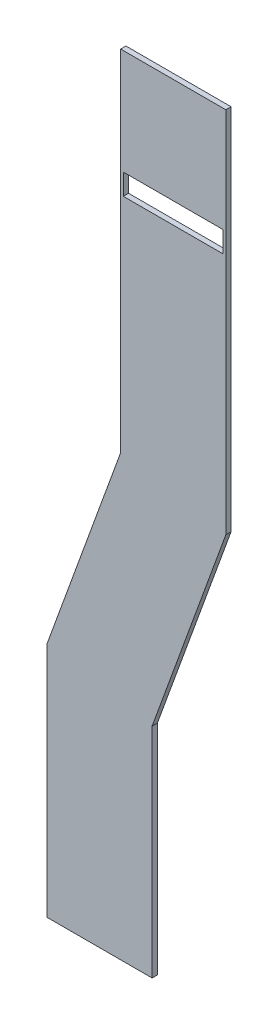
ISO-10303-21;
HEADER;
FILE_DESCRIPTION(('STEP AP214'),'2;1');
FILE_NAME('part.step','',(''),(''),'','','');
FILE_SCHEMA(('AUTOMOTIVE_DESIGN { 1 0 10303 214 1 1 1 1 }'));
ENDSEC;
DATA;
#1=APPLICATION_CONTEXT('core data for automotive mechanical design processes');
#2=APPLICATION_PROTOCOL_DEFINITION('international standard','automotive_design',2000,#1);
#3=PRODUCT_CONTEXT('',#1,'mechanical');
#4=PRODUCT('Part','Part','',(#3));
#5=PRODUCT_RELATED_PRODUCT_CATEGORY('part','',(#4));
#6=PRODUCT_DEFINITION_FORMATION('','',#4);
#7=PRODUCT_DEFINITION_CONTEXT('part definition',#1,'design');
#8=PRODUCT_DEFINITION('design','',#6,#7);
#9=PRODUCT_DEFINITION_SHAPE('','',#8);
#10=(LENGTH_UNIT() NAMED_UNIT(*) SI_UNIT(.MILLI.,.METRE.));
#11=(NAMED_UNIT(*) PLANE_ANGLE_UNIT() SI_UNIT($,.RADIAN.));
#12=(NAMED_UNIT(*) SI_UNIT($,.STERADIAN.) SOLID_ANGLE_UNIT());
#13=UNCERTAINTY_MEASURE_WITH_UNIT(LENGTH_MEASURE(1.E-05),#10,'distance_accuracy_value','');
#14=(GEOMETRIC_REPRESENTATION_CONTEXT(3) GLOBAL_UNCERTAINTY_ASSIGNED_CONTEXT((#13)) GLOBAL_UNIT_ASSIGNED_CONTEXT((#10,
#11,#12)) REPRESENTATION_CONTEXT('',''));
#15=CARTESIAN_POINT('',(0.,0.,0.));
#16=DIRECTION('',(0.,0.,1.));
#17=DIRECTION('',(1.,0.,0.));
#18=AXIS2_PLACEMENT_3D('',#15,#16,#17);
#19=CARTESIAN_POINT('',(-20.,0.,1.));
#20=DIRECTION('',(1.,0.,0.));
#21=DIRECTION('',(0.,1.,0.));
#22=AXIS2_PLACEMENT_3D('',#19,#20,#21);
#23=PLANE('',#22);
#24=DIRECTION('',(0.,-1.,0.));
#25=VECTOR('',#24,1.);
#26=CARTESIAN_POINT('',(-20.,0.,0.));
#27=LINE('',#26,#25);
#28=CARTESIAN_POINT('',(-20.,0.,0.));
#29=VERTEX_POINT('',#28);
#30=CARTESIAN_POINT('',(-20.,-66.4734603858307,0.));
#31=VERTEX_POINT('',#30);
#32=EDGE_CURVE('E173',#29,#31,#27,.T.);
#33=ORIENTED_EDGE('',*,*,#32,.T.);
#34=DIRECTION('',(0.,0.,-1.));
#35=VECTOR('',#34,1.);
#36=CARTESIAN_POINT('',(-20.,-66.4734603858307,1.));
#37=LINE('',#36,#35);
#38=CARTESIAN_POINT('',(-20.,-66.4734603858307,1.));
#39=VERTEX_POINT('',#38);
#40=EDGE_CURVE('E11',#39,#31,#37,.T.);
#41=ORIENTED_EDGE('',*,*,#40,.F.);
#42=DIRECTION('',(0.,-1.,0.));
#43=VECTOR('',#42,1.);
#44=CARTESIAN_POINT('',(-20.,0.,1.));
#45=LINE('',#44,#43);
#46=CARTESIAN_POINT('',(-20.,0.,1.));
#47=VERTEX_POINT('',#46);
#48=EDGE_CURVE('E174',#47,#39,#45,.T.);
#49=ORIENTED_EDGE('',*,*,#48,.F.);
#50=DIRECTION('',(0.,0.,-1.));
#51=VECTOR('',#50,1.);
#52=CARTESIAN_POINT('',(-20.,0.,1.));
#53=LINE('',#52,#51);
#54=EDGE_CURVE('E200',#47,#29,#53,.T.);
#55=ORIENTED_EDGE('',*,*,#54,.T.);
#56=EDGE_LOOP('',(#33,#41,#49,#55));
#57=FACE_BOUND('',#56,.T.);
#58=ADVANCED_FACE('F38',(#57),#23,.F.);
#59=CARTESIAN_POINT('',(-20.,-66.4734603858307,1.));
#60=DIRECTION('',(0.939692620785908,-0.34202014332567,0.));
#61=DIRECTION('',(0.34202014332567,0.939692620785908,0.));
#62=AXIS2_PLACEMENT_3D('',#59,#60,#61);
#63=PLANE('',#62);
#64=DIRECTION('',(-0.34202014332567,-0.939692620785908,0.));
#65=VECTOR('',#64,1.);
#66=CARTESIAN_POINT('',(-20.,-66.4734603858307,0.));
#67=LINE('',#66,#65);
#68=CARTESIAN_POINT('',(-34.0225136488354,-105.,0.));
#69=VERTEX_POINT('',#68);
#70=EDGE_CURVE('E204',#31,#69,#67,.T.);
#71=ORIENTED_EDGE('',*,*,#70,.T.);
#72=DIRECTION('',(0.,0.,-1.));
#73=VECTOR('',#72,1.);
#74=CARTESIAN_POINT('',(-34.0225136488354,-105.,1.));
#75=LINE('',#74,#73);
#76=CARTESIAN_POINT('',(-34.0225136488354,-105.,1.));
#77=VERTEX_POINT('',#76);
#78=EDGE_CURVE('E46',#77,#69,#75,.T.);
#79=ORIENTED_EDGE('',*,*,#78,.F.);
#80=DIRECTION('',(-0.34202014332567,-0.939692620785908,0.));
#81=VECTOR('',#80,1.);
#82=CARTESIAN_POINT('',(-20.,-66.4734603858307,1.));
#83=LINE('',#82,#81);
#84=EDGE_CURVE('E178',#39,#77,#83,.T.);
#85=ORIENTED_EDGE('',*,*,#84,.F.);
#86=ORIENTED_EDGE('',*,*,#40,.T.);
#87=EDGE_LOOP('',(#71,#79,#85,#86));
#88=FACE_BOUND('',#87,.T.);
#89=ADVANCED_FACE('F273',(#88),#63,.F.);
#90=CARTESIAN_POINT('',(-34.0225136488354,-105.,1.));
#91=DIRECTION('',(1.,0.,0.));
#92=DIRECTION('',(0.,1.,0.));
#93=AXIS2_PLACEMENT_3D('',#90,#91,#92);
#94=PLANE('',#93);
#95=DIRECTION('',(0.,-1.,0.));
#96=VECTOR('',#95,1.);
#97=CARTESIAN_POINT('',(-34.0225136488354,-105.,0.));
#98=LINE('',#97,#96);
#99=CARTESIAN_POINT('',(-34.0225136488354,-150.,0.));
#100=VERTEX_POINT('',#99);
#101=EDGE_CURVE('E207',#69,#100,#98,.T.);
#102=ORIENTED_EDGE('',*,*,#101,.T.);
#103=DIRECTION('',(0.,0.,-1.));
#104=VECTOR('',#103,1.);
#105=CARTESIAN_POINT('',(-34.0225136488354,-150.,1.));
#106=LINE('',#105,#104);
#107=CARTESIAN_POINT('',(-34.0225136488354,-150.,1.));
#108=VERTEX_POINT('',#107);
#109=EDGE_CURVE('E243',#108,#100,#106,.T.);
#110=ORIENTED_EDGE('',*,*,#109,.F.);
#111=DIRECTION('',(0.,-1.,0.));
#112=VECTOR('',#111,1.);
#113=CARTESIAN_POINT('',(-34.0225136488354,-105.,1.));
#114=LINE('',#113,#112);
#115=EDGE_CURVE('E182',#77,#108,#114,.T.);
#116=ORIENTED_EDGE('',*,*,#115,.F.);
#117=ORIENTED_EDGE('',*,*,#78,.T.);
#118=EDGE_LOOP('',(#102,#110,#116,#117));
#119=FACE_BOUND('',#118,.T.);
#120=ADVANCED_FACE('F252',(#119),#94,.F.);
#121=CARTESIAN_POINT('',(-34.0225136488354,-150.,1.));
#122=DIRECTION('',(0.,1.,0.));
#123=DIRECTION('',(0.,0.,1.));
#124=AXIS2_PLACEMENT_3D('',#121,#122,#123);
#125=PLANE('',#124);
#126=DIRECTION('',(1.,0.,0.));
#127=VECTOR('',#126,1.);
#128=CARTESIAN_POINT('',(-34.0225136488354,-150.,0.));
#129=LINE('',#128,#127);
#130=CARTESIAN_POINT('',(-14.0225136488354,-150.,0.));
#131=VERTEX_POINT('',#130);
#132=EDGE_CURVE('E210',#100,#131,#129,.T.);
#133=ORIENTED_EDGE('',*,*,#132,.T.);
#134=DIRECTION('',(0.,0.,-1.));
#135=VECTOR('',#134,1.);
#136=CARTESIAN_POINT('',(-14.0225136488354,-150.,1.));
#137=LINE('',#136,#135);
#138=CARTESIAN_POINT('',(-14.0225136488354,-150.,1.));
#139=VERTEX_POINT('',#138);
#140=EDGE_CURVE('E239',#139,#131,#137,.T.);
#141=ORIENTED_EDGE('',*,*,#140,.F.);
#142=DIRECTION('',(1.,0.,0.));
#143=VECTOR('',#142,1.);
#144=CARTESIAN_POINT('',(-34.0225136488354,-150.,1.));
#145=LINE('',#144,#143);
#146=EDGE_CURVE('E185',#108,#139,#145,.T.);
#147=ORIENTED_EDGE('',*,*,#146,.F.);
#148=ORIENTED_EDGE('',*,*,#109,.T.);
#149=EDGE_LOOP('',(#133,#141,#147,#148));
#150=FACE_BOUND('',#149,.T.);
#151=ADVANCED_FACE('F263',(#150),#125,.F.);
#152=CARTESIAN_POINT('',(-14.0225136488354,-150.,1.));
#153=DIRECTION('',(-1.,0.,0.));
#154=DIRECTION('',(0.,0.,1.));
#155=AXIS2_PLACEMENT_3D('',#152,#153,#154);
#156=PLANE('',#155);
#157=DIRECTION('',(0.,1.,0.));
#158=VECTOR('',#157,1.);
#159=CARTESIAN_POINT('',(-14.0225136488354,-150.,0.));
#160=LINE('',#159,#158);
#161=CARTESIAN_POINT('',(-14.0225136488354,-108.526539614169,0.));
#162=VERTEX_POINT('',#161);
#163=EDGE_CURVE('E213',#131,#162,#160,.T.);
#164=ORIENTED_EDGE('',*,*,#163,.T.);
#165=DIRECTION('',(0.,0.,-1.));
#166=VECTOR('',#165,1.);
#167=CARTESIAN_POINT('',(-14.0225136488354,-108.526539614169,1.));
#168=LINE('',#167,#166);
#169=CARTESIAN_POINT('',(-14.0225136488354,-108.526539614169,1.));
#170=VERTEX_POINT('',#169);
#171=EDGE_CURVE('E235',#170,#162,#168,.T.);
#172=ORIENTED_EDGE('',*,*,#171,.F.);
#173=DIRECTION('',(0.,1.,0.));
#174=VECTOR('',#173,1.);
#175=CARTESIAN_POINT('',(-14.0225136488354,-150.,1.));
#176=LINE('',#175,#174);
#177=EDGE_CURVE('E188',#139,#170,#176,.T.);
#178=ORIENTED_EDGE('',*,*,#177,.F.);
#179=ORIENTED_EDGE('',*,*,#140,.T.);
#180=EDGE_LOOP('',(#164,#172,#178,#179));
#181=FACE_BOUND('',#180,.T.);
#182=ADVANCED_FACE('F267',(#181),#156,.F.);
#183=CARTESIAN_POINT('',(-14.0225136488354,-108.526539614169,1.));
#184=DIRECTION('',(-0.939692620785908,0.34202014332567,0.));
#185=DIRECTION('',(-0.34202014332567,-0.939692620785908,0.));
#186=AXIS2_PLACEMENT_3D('',#183,#184,#185);
#187=PLANE('',#186);
#188=DIRECTION('',(0.34202014332567,0.939692620785908,0.));
#189=VECTOR('',#188,1.);
#190=CARTESIAN_POINT('',(-14.0225136488354,-108.526539614169,0.));
#191=LINE('',#190,#189);
#192=CARTESIAN_POINT('',(0.,-70.,0.));
#193=VERTEX_POINT('',#192);
#194=EDGE_CURVE('E216',#162,#193,#191,.T.);
#195=ORIENTED_EDGE('',*,*,#194,.T.);
#196=DIRECTION('',(0.,0.,-1.));
#197=VECTOR('',#196,1.);
#198=CARTESIAN_POINT('',(0.,-70.,1.));
#199=LINE('',#198,#197);
#200=CARTESIAN_POINT('',(0.,-70.,1.));
#201=VERTEX_POINT('',#200);
#202=EDGE_CURVE('E231',#201,#193,#199,.T.);
#203=ORIENTED_EDGE('',*,*,#202,.F.);
#204=DIRECTION('',(0.34202014332567,0.939692620785908,0.));
#205=VECTOR('',#204,1.);
#206=CARTESIAN_POINT('',(-14.0225136488354,-108.526539614169,1.));
#207=LINE('',#206,#205);
#208=EDGE_CURVE('E191',#170,#201,#207,.T.);
#209=ORIENTED_EDGE('',*,*,#208,.F.);
#210=ORIENTED_EDGE('',*,*,#171,.T.);
#211=EDGE_LOOP('',(#195,#203,#209,#210));
#212=FACE_BOUND('',#211,.T.);
#213=ADVANCED_FACE('F286',(#212),#187,.F.);
#214=CARTESIAN_POINT('',(0.,-70.,1.));
#215=DIRECTION('',(-1.,0.,0.));
#216=DIRECTION('',(0.,-1.,0.));
#217=AXIS2_PLACEMENT_3D('',#214,#215,#216);
#218=PLANE('',#217);
#219=DIRECTION('',(0.,1.,0.));
#220=VECTOR('',#219,1.);
#221=CARTESIAN_POINT('',(0.,-70.,0.));
#222=LINE('',#221,#220);
#223=CARTESIAN_POINT('',(0.,0.,0.));
#224=VERTEX_POINT('',#223);
#225=EDGE_CURVE('E219',#193,#224,#222,.T.);
#226=ORIENTED_EDGE('',*,*,#225,.T.);
#227=DIRECTION('',(0.,0.,-1.));
#228=VECTOR('',#227,1.);
#229=CARTESIAN_POINT('',(0.,0.,1.));
#230=LINE('',#229,#228);
#231=CARTESIAN_POINT('',(0.,0.,1.));
#232=VERTEX_POINT('',#231);
#233=EDGE_CURVE('E227',#232,#224,#230,.T.);
#234=ORIENTED_EDGE('',*,*,#233,.F.);
#235=DIRECTION('',(0.,1.,0.));
#236=VECTOR('',#235,1.);
#237=CARTESIAN_POINT('',(0.,-70.,1.));
#238=LINE('',#237,#236);
#239=EDGE_CURVE('E194',#201,#232,#238,.T.);
#240=ORIENTED_EDGE('',*,*,#239,.F.);
#241=ORIENTED_EDGE('',*,*,#202,.T.);
#242=EDGE_LOOP('',(#226,#234,#240,#241));
#243=FACE_BOUND('',#242,.T.);
#244=ADVANCED_FACE('F284',(#243),#218,.F.);
#245=CARTESIAN_POINT('',(0.,0.,1.));
#246=DIRECTION('',(0.,-1.,0.));
#247=DIRECTION('',(1.,0.,0.));
#248=AXIS2_PLACEMENT_3D('',#245,#246,#247);
#249=PLANE('',#248);
#250=DIRECTION('',(-1.,0.,0.));
#251=VECTOR('',#250,1.);
#252=CARTESIAN_POINT('',(0.,0.,0.));
#253=LINE('',#252,#251);
#254=EDGE_CURVE('E179',#224,#29,#253,.T.);
#255=ORIENTED_EDGE('',*,*,#254,.T.);
#256=ORIENTED_EDGE('',*,*,#54,.F.);
#257=DIRECTION('',(-1.,0.,0.));
#258=VECTOR('',#257,1.);
#259=CARTESIAN_POINT('',(0.,0.,1.));
#260=LINE('',#259,#258);
#261=EDGE_CURVE('E197',#232,#47,#260,.T.);
#262=ORIENTED_EDGE('',*,*,#261,.F.);
#263=ORIENTED_EDGE('',*,*,#233,.T.);
#264=EDGE_LOOP('',(#255,#256,#262,#263));
#265=FACE_BOUND('',#264,.T.);
#266=ADVANCED_FACE('F279',(#265),#249,.F.);
#267=CARTESIAN_POINT('',(0.,0.,1.));
#268=DIRECTION('',(0.,0.,1.));
#269=DIRECTION('',(1.,0.,0.));
#270=AXIS2_PLACEMENT_3D('',#267,#268,#269);
#271=PLANE('',#270);
#272=DIRECTION('',(1.,0.,0.));
#273=VECTOR('',#272,1.);
#274=CARTESIAN_POINT('',(-19.5,-20.,1.));
#275=LINE('',#274,#273);
#276=CARTESIAN_POINT('',(-19.5,-20.,1.));
#277=VERTEX_POINT('',#276);
#278=CARTESIAN_POINT('',(-0.499999999999998,-20.,1.));
#279=VERTEX_POINT('',#278);
#280=EDGE_CURVE('E142',#277,#279,#275,.T.);
#281=ORIENTED_EDGE('',*,*,#280,.T.);
#282=DIRECTION('',(0.,-1.,0.));
#283=VECTOR('',#282,1.);
#284=CARTESIAN_POINT('',(-0.499999999999998,-20.,1.));
#285=LINE('',#284,#283);
#286=CARTESIAN_POINT('',(-0.499999999999999,-24.,1.));
#287=VERTEX_POINT('',#286);
#288=EDGE_CURVE('E128',#279,#287,#285,.T.);
#289=ORIENTED_EDGE('',*,*,#288,.T.);
#290=DIRECTION('',(-1.,0.,0.));
#291=VECTOR('',#290,1.);
#292=CARTESIAN_POINT('',(-0.499999999999999,-24.,1.));
#293=LINE('',#292,#291);
#294=CARTESIAN_POINT('',(-19.5,-24.,1.));
#295=VERTEX_POINT('',#294);
#296=EDGE_CURVE('E164',#287,#295,#293,.T.);
#297=ORIENTED_EDGE('',*,*,#296,.T.);
#298=DIRECTION('',(0.,1.,0.));
#299=VECTOR('',#298,1.);
#300=CARTESIAN_POINT('',(-19.5,-24.,1.));
#301=LINE('',#300,#299);
#302=EDGE_CURVE('E151',#295,#277,#301,.T.);
#303=ORIENTED_EDGE('',*,*,#302,.T.);
#304=EDGE_LOOP('',(#281,#289,#297,#303));
#305=FACE_BOUND('',#304,.T.);
#306=ORIENTED_EDGE('',*,*,#48,.T.);
#307=ORIENTED_EDGE('',*,*,#84,.T.);
#308=ORIENTED_EDGE('',*,*,#115,.T.);
#309=ORIENTED_EDGE('',*,*,#146,.T.);
#310=ORIENTED_EDGE('',*,*,#177,.T.);
#311=ORIENTED_EDGE('',*,*,#208,.T.);
#312=ORIENTED_EDGE('',*,*,#239,.T.);
#313=ORIENTED_EDGE('',*,*,#261,.T.);
#314=EDGE_LOOP('',(#306,#307,#308,#309,#310,#311,#312,#313));
#315=FACE_BOUND('',#314,.T.);
#316=ADVANCED_FACE('F149',(#305,#315),#271,.T.);
#317=CARTESIAN_POINT('',(0.,0.,0.));
#318=DIRECTION('',(0.,0.,1.));
#319=DIRECTION('',(1.,0.,0.));
#320=AXIS2_PLACEMENT_3D('',#317,#318,#319);
#321=PLANE('',#320);
#322=DIRECTION('',(0.,-1.,0.));
#323=VECTOR('',#322,1.);
#324=CARTESIAN_POINT('',(-0.499999999999998,-20.,0.));
#325=LINE('',#324,#323);
#326=CARTESIAN_POINT('',(-0.499999999999998,-20.,0.));
#327=VERTEX_POINT('',#326);
#328=CARTESIAN_POINT('',(-0.499999999999999,-24.,0.));
#329=VERTEX_POINT('',#328);
#330=EDGE_CURVE('E155',#327,#329,#325,.T.);
#331=ORIENTED_EDGE('',*,*,#330,.F.);
#332=DIRECTION('',(1.,0.,0.));
#333=VECTOR('',#332,1.);
#334=CARTESIAN_POINT('',(-19.5,-20.,0.));
#335=LINE('',#334,#333);
#336=CARTESIAN_POINT('',(-19.5,-20.,0.));
#337=VERTEX_POINT('',#336);
#338=EDGE_CURVE('E145',#337,#327,#335,.T.);
#339=ORIENTED_EDGE('',*,*,#338,.F.);
#340=DIRECTION('',(0.,1.,0.));
#341=VECTOR('',#340,1.);
#342=CARTESIAN_POINT('',(-19.5,-24.,0.));
#343=LINE('',#342,#341);
#344=CARTESIAN_POINT('',(-19.5,-24.,0.));
#345=VERTEX_POINT('',#344);
#346=EDGE_CURVE('E159',#345,#337,#343,.T.);
#347=ORIENTED_EDGE('',*,*,#346,.F.);
#348=DIRECTION('',(-1.,0.,0.));
#349=VECTOR('',#348,1.);
#350=CARTESIAN_POINT('',(-0.499999999999999,-24.,0.));
#351=LINE('',#350,#349);
#352=EDGE_CURVE('E61',#329,#345,#351,.T.);
#353=ORIENTED_EDGE('',*,*,#352,.F.);
#354=EDGE_LOOP('',(#331,#339,#347,#353));
#355=FACE_BOUND('',#354,.T.);
#356=ORIENTED_EDGE('',*,*,#32,.F.);
#357=ORIENTED_EDGE('',*,*,#254,.F.);
#358=ORIENTED_EDGE('',*,*,#225,.F.);
#359=ORIENTED_EDGE('',*,*,#194,.F.);
#360=ORIENTED_EDGE('',*,*,#163,.F.);
#361=ORIENTED_EDGE('',*,*,#132,.F.);
#362=ORIENTED_EDGE('',*,*,#101,.F.);
#363=ORIENTED_EDGE('',*,*,#70,.F.);
#364=EDGE_LOOP('',(#356,#357,#358,#359,#360,#361,#362,#363));
#365=FACE_BOUND('',#364,.T.);
#366=ADVANCED_FACE('F258',(#355,#365),#321,.F.);
#367=CARTESIAN_POINT('',(-19.5,-20.,20.4164878389476));
#368=DIRECTION('',(0.,1.,0.));
#369=DIRECTION('',(-1.,0.,0.));
#370=AXIS2_PLACEMENT_3D('',#367,#368,#369);
#371=PLANE('',#370);
#372=DIRECTION('',(0.,0.,-1.));
#373=VECTOR('',#372,1.);
#374=CARTESIAN_POINT('',(-19.5,-20.,20.4164878389476));
#375=LINE('',#374,#373);
#376=EDGE_CURVE('E53',#277,#337,#375,.T.);
#377=ORIENTED_EDGE('',*,*,#376,.T.);
#378=ORIENTED_EDGE('',*,*,#338,.T.);
#379=DIRECTION('',(0.,0.,-1.));
#380=VECTOR('',#379,1.);
#381=CARTESIAN_POINT('',(-0.499999999999998,-20.,20.4164878389476));
#382=LINE('',#381,#380);
#383=EDGE_CURVE('E132',#279,#327,#382,.T.);
#384=ORIENTED_EDGE('',*,*,#383,.F.);
#385=ORIENTED_EDGE('',*,*,#280,.F.);
#386=EDGE_LOOP('',(#377,#378,#384,#385));
#387=FACE_BOUND('',#386,.T.);
#388=ADVANCED_FACE('F141',(#387),#371,.F.);
#389=CARTESIAN_POINT('',(-0.499999999999998,-20.,20.4164878389476));
#390=DIRECTION('',(1.,0.,0.));
#391=DIRECTION('',(0.,1.,0.));
#392=AXIS2_PLACEMENT_3D('',#389,#390,#391);
#393=PLANE('',#392);
#394=ORIENTED_EDGE('',*,*,#383,.T.);
#395=ORIENTED_EDGE('',*,*,#330,.T.);
#396=DIRECTION('',(0.,0.,-1.));
#397=VECTOR('',#396,1.);
#398=CARTESIAN_POINT('',(-0.499999999999999,-24.,20.4164878389476));
#399=LINE('',#398,#397);
#400=EDGE_CURVE('E134',#287,#329,#399,.T.);
#401=ORIENTED_EDGE('',*,*,#400,.F.);
#402=ORIENTED_EDGE('',*,*,#288,.F.);
#403=EDGE_LOOP('',(#394,#395,#401,#402));
#404=FACE_BOUND('',#403,.T.);
#405=ADVANCED_FACE('F130',(#404),#393,.F.);
#406=CARTESIAN_POINT('',(-0.499999999999999,-24.,20.4164878389476));
#407=DIRECTION('',(0.,-1.,0.));
#408=DIRECTION('',(0.,0.,-1.));
#409=AXIS2_PLACEMENT_3D('',#406,#407,#408);
#410=PLANE('',#409);
#411=ORIENTED_EDGE('',*,*,#400,.T.);
#412=ORIENTED_EDGE('',*,*,#352,.T.);
#413=DIRECTION('',(0.,0.,-1.));
#414=VECTOR('',#413,1.);
#415=CARTESIAN_POINT('',(-19.5,-24.,20.4164878389476));
#416=LINE('',#415,#414);
#417=EDGE_CURVE('E163',#295,#345,#416,.T.);
#418=ORIENTED_EDGE('',*,*,#417,.F.);
#419=ORIENTED_EDGE('',*,*,#296,.F.);
#420=EDGE_LOOP('',(#411,#412,#418,#419));
#421=FACE_BOUND('',#420,.T.);
#422=ADVANCED_FACE('F361',(#421),#410,.F.);
#423=CARTESIAN_POINT('',(-19.5,-24.,20.4164878389476));
#424=DIRECTION('',(-1.,0.,0.));
#425=DIRECTION('',(0.,0.,1.));
#426=AXIS2_PLACEMENT_3D('',#423,#424,#425);
#427=PLANE('',#426);
#428=ORIENTED_EDGE('',*,*,#417,.T.);
#429=ORIENTED_EDGE('',*,*,#346,.T.);
#430=ORIENTED_EDGE('',*,*,#376,.F.);
#431=ORIENTED_EDGE('',*,*,#302,.F.);
#432=EDGE_LOOP('',(#428,#429,#430,#431));
#433=FACE_BOUND('',#432,.T.);
#434=ADVANCED_FACE('F370',(#433),#427,.F.);
#435=CLOSED_SHELL('',(#58,#89,#120,#151,#182,#213,#244,#266,#316,#366,#388,#405,#422,#434));
#436=MANIFOLD_SOLID_BREP('B2',#435);
#437=ADVANCED_BREP_SHAPE_REPRESENTATION('',(#18,#436),#14);
#438=SHAPE_DEFINITION_REPRESENTATION(#9,#437);
ENDSEC;
END-ISO-10303-21;
